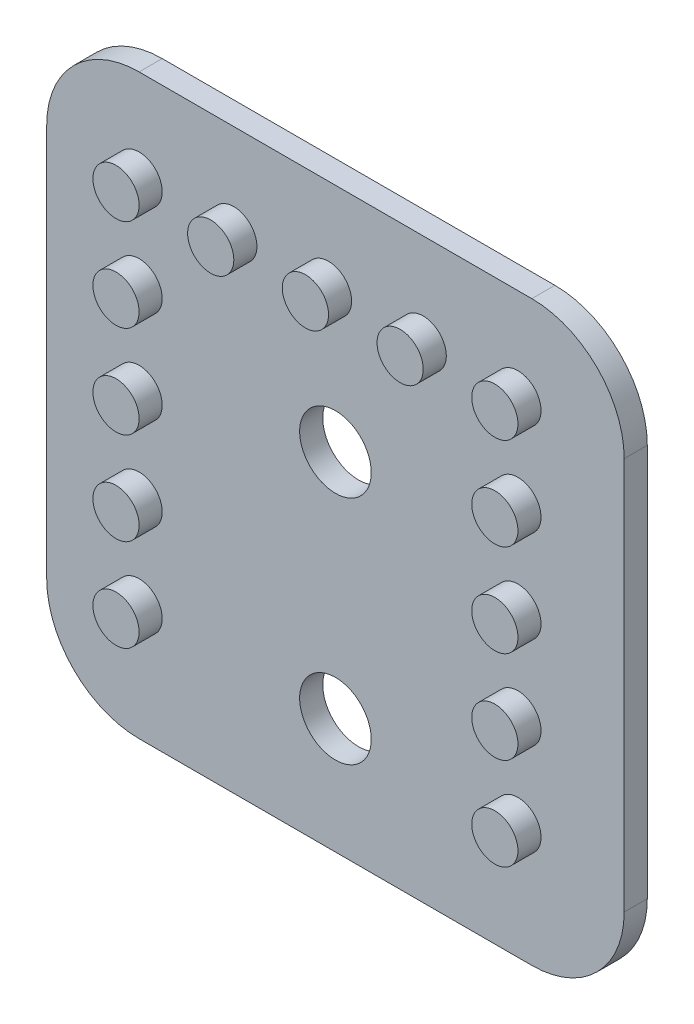
ISO-10303-21;
HEADER;
FILE_DESCRIPTION(('STEP AP214'),'2;1');
FILE_NAME('part.step','',(''),(''),'','','');
FILE_SCHEMA(('AUTOMOTIVE_DESIGN { 1 0 10303 214 1 1 1 1 }'));
ENDSEC;
DATA;
#1=APPLICATION_CONTEXT('core data for automotive mechanical design processes');
#2=APPLICATION_PROTOCOL_DEFINITION('international standard','automotive_design',2000,#1);
#3=PRODUCT_CONTEXT('',#1,'mechanical');
#4=PRODUCT('Part','Part','',(#3));
#5=PRODUCT_RELATED_PRODUCT_CATEGORY('part','',(#4));
#6=PRODUCT_DEFINITION_FORMATION('','',#4);
#7=PRODUCT_DEFINITION_CONTEXT('part definition',#1,'design');
#8=PRODUCT_DEFINITION('design','',#6,#7);
#9=PRODUCT_DEFINITION_SHAPE('','',#8);
#10=(LENGTH_UNIT() NAMED_UNIT(*) SI_UNIT(.MILLI.,.METRE.));
#11=(NAMED_UNIT(*) PLANE_ANGLE_UNIT() SI_UNIT($,.RADIAN.));
#12=(NAMED_UNIT(*) SI_UNIT($,.STERADIAN.) SOLID_ANGLE_UNIT());
#13=UNCERTAINTY_MEASURE_WITH_UNIT(LENGTH_MEASURE(1.E-05),#10,'distance_accuracy_value','');
#14=(GEOMETRIC_REPRESENTATION_CONTEXT(3) GLOBAL_UNCERTAINTY_ASSIGNED_CONTEXT((#13)) GLOBAL_UNIT_ASSIGNED_CONTEXT((#10,
#11,#12)) REPRESENTATION_CONTEXT('',''));
#15=CARTESIAN_POINT('',(0.,0.,0.));
#16=DIRECTION('',(0.,0.,1.));
#17=DIRECTION('',(1.,0.,0.));
#18=AXIS2_PLACEMENT_3D('',#15,#16,#17);
#19=CARTESIAN_POINT('',(0.,0.,1.));
#20=DIRECTION('',(0.,0.,1.));
#21=DIRECTION('',(1.,0.,0.));
#22=AXIS2_PLACEMENT_3D('',#19,#20,#21);
#23=PLANE('',#22);
#24=CARTESIAN_POINT('',(-23.5,13.,1.));
#25=DIRECTION('',(0.,0.,1.));
#26=DIRECTION('',(1.,0.,0.));
#27=AXIS2_PLACEMENT_3D('',#24,#25,#26);
#28=CIRCLE('',#27,1.55);
#29=CARTESIAN_POINT('',(-21.95,13.,1.));
#30=VERTEX_POINT('',#29);
#31=EDGE_CURVE('E257',#30,#30,#28,.T.);
#32=ORIENTED_EDGE('',*,*,#31,.F.);
#33=EDGE_LOOP('',(#32));
#34=FACE_BOUND('',#33,.T.);
#35=CARTESIAN_POINT('',(-23.5,23.,1.));
#36=DIRECTION('',(0.,0.,1.));
#37=DIRECTION('',(1.,0.,0.));
#38=AXIS2_PLACEMENT_3D('',#35,#36,#37);
#39=CIRCLE('',#38,1.55);
#40=CARTESIAN_POINT('',(-21.95,23.,1.));
#41=VERTEX_POINT('',#40);
#42=EDGE_CURVE('E251',#41,#41,#39,.T.);
#43=ORIENTED_EDGE('',*,*,#42,.F.);
#44=EDGE_LOOP('',(#43));
#45=FACE_BOUND('',#44,.T.);
#46=CARTESIAN_POINT('',(-31.9999999999998,13.,1.));
#47=DIRECTION('',(0.,0.,1.));
#48=DIRECTION('',(1.,0.,0.));
#49=AXIS2_PLACEMENT_3D('',#46,#47,#48);
#50=CIRCLE('',#49,0.999999999999998);
#51=CARTESIAN_POINT('',(-30.9999999999998,13.,1.));
#52=VERTEX_POINT('',#51);
#53=EDGE_CURVE('E237',#52,#52,#50,.T.);
#54=ORIENTED_EDGE('',*,*,#53,.F.);
#55=EDGE_LOOP('',(#54));
#56=FACE_BOUND('',#55,.T.);
#57=CARTESIAN_POINT('',(-31.9999999999999,17.,1.));
#58=DIRECTION('',(0.,0.,1.));
#59=DIRECTION('',(1.,0.,0.));
#60=AXIS2_PLACEMENT_3D('',#57,#58,#59);
#61=CIRCLE('',#60,0.999999999999998);
#62=CARTESIAN_POINT('',(-30.9999999999999,17.,1.));
#63=VERTEX_POINT('',#62);
#64=EDGE_CURVE('E225',#63,#63,#61,.T.);
#65=ORIENTED_EDGE('',*,*,#64,.F.);
#66=EDGE_LOOP('',(#65));
#67=FACE_BOUND('',#66,.T.);
#68=CARTESIAN_POINT('',(-31.9999999999999,21.,1.));
#69=DIRECTION('',(0.,0.,1.));
#70=DIRECTION('',(1.,0.,0.));
#71=AXIS2_PLACEMENT_3D('',#68,#69,#70);
#72=CIRCLE('',#71,0.999999999999998);
#73=CARTESIAN_POINT('',(-30.9999999999999,21.,1.));
#74=VERTEX_POINT('',#73);
#75=EDGE_CURVE('E213',#74,#74,#72,.T.);
#76=ORIENTED_EDGE('',*,*,#75,.F.);
#77=EDGE_LOOP('',(#76));
#78=FACE_BOUND('',#77,.T.);
#79=CARTESIAN_POINT('',(-32.,25.,1.));
#80=DIRECTION('',(0.,0.,1.));
#81=DIRECTION('',(1.,0.,0.));
#82=AXIS2_PLACEMENT_3D('',#79,#80,#81);
#83=CIRCLE('',#82,0.999999999999998);
#84=CARTESIAN_POINT('',(-31.,25.,1.));
#85=VERTEX_POINT('',#84);
#86=EDGE_CURVE('E201',#85,#85,#83,.T.);
#87=ORIENTED_EDGE('',*,*,#86,.F.);
#88=EDGE_LOOP('',(#87));
#89=FACE_BOUND('',#88,.T.);
#90=CARTESIAN_POINT('',(-19.7,29.,1.));
#91=DIRECTION('',(0.,0.,1.));
#92=DIRECTION('',(1.,0.,0.));
#93=AXIS2_PLACEMENT_3D('',#90,#91,#92);
#94=CIRCLE('',#93,0.999999999999998);
#95=CARTESIAN_POINT('',(-18.7,29.,1.));
#96=VERTEX_POINT('',#95);
#97=EDGE_CURVE('E189',#96,#96,#94,.T.);
#98=ORIENTED_EDGE('',*,*,#97,.F.);
#99=EDGE_LOOP('',(#98));
#100=FACE_BOUND('',#99,.T.);
#101=CARTESIAN_POINT('',(-27.9,29.,1.));
#102=DIRECTION('',(0.,0.,1.));
#103=DIRECTION('',(1.,0.,0.));
#104=AXIS2_PLACEMENT_3D('',#101,#102,#103);
#105=CIRCLE('',#104,0.999999999999998);
#106=CARTESIAN_POINT('',(-26.9,29.,1.));
#107=VERTEX_POINT('',#106);
#108=EDGE_CURVE('E177',#107,#107,#105,.T.);
#109=ORIENTED_EDGE('',*,*,#108,.F.);
#110=EDGE_LOOP('',(#109));
#111=FACE_BOUND('',#110,.T.);
#112=DIRECTION('',(0.,-1.,0.));
#113=VECTOR('',#112,1.);
#114=CARTESIAN_POINT('',(-36.,8.,1.));
#115=LINE('',#114,#113);
#116=CARTESIAN_POINT('',(-36.,29.,1.));
#117=VERTEX_POINT('',#116);
#118=CARTESIAN_POINT('',(-36.,12.,1.));
#119=VERTEX_POINT('',#118);
#120=EDGE_CURVE('E170',#117,#119,#115,.T.);
#121=ORIENTED_EDGE('',*,*,#120,.T.);
#122=CARTESIAN_POINT('',(-32.,12.,1.));
#123=DIRECTION('',(0.,0.,1.));
#124=DIRECTION('',(1.,0.,0.));
#125=AXIS2_PLACEMENT_3D('',#122,#123,#124);
#126=CIRCLE('',#125,4.);
#127=CARTESIAN_POINT('',(-32.,8.,1.));
#128=VERTEX_POINT('',#127);
#129=EDGE_CURVE('E147',#119,#128,#126,.T.);
#130=ORIENTED_EDGE('',*,*,#129,.T.);
#131=DIRECTION('',(1.,0.,0.));
#132=VECTOR('',#131,1.);
#133=CARTESIAN_POINT('',(-11.,8.00000000000001,1.));
#134=LINE('',#133,#132);
#135=CARTESIAN_POINT('',(-15.,8.00000000000001,1.));
#136=VERTEX_POINT('',#135);
#137=EDGE_CURVE('E119',#128,#136,#134,.T.);
#138=ORIENTED_EDGE('',*,*,#137,.T.);
#139=CARTESIAN_POINT('',(-15.,12.,1.));
#140=DIRECTION('',(0.,0.,1.));
#141=DIRECTION('',(1.,0.,0.));
#142=AXIS2_PLACEMENT_3D('',#139,#140,#141);
#143=CIRCLE('',#142,4.);
#144=CARTESIAN_POINT('',(-11.,12.,1.));
#145=VERTEX_POINT('',#144);
#146=EDGE_CURVE('E145',#136,#145,#143,.T.);
#147=ORIENTED_EDGE('',*,*,#146,.T.);
#148=DIRECTION('',(0.,1.,0.));
#149=VECTOR('',#148,1.);
#150=CARTESIAN_POINT('',(-11.,8.00000000000001,1.));
#151=LINE('',#150,#149);
#152=CARTESIAN_POINT('',(-11.,29.,1.));
#153=VERTEX_POINT('',#152);
#154=EDGE_CURVE('E125',#145,#153,#151,.T.);
#155=ORIENTED_EDGE('',*,*,#154,.T.);
#156=CARTESIAN_POINT('',(-15.,29.,1.));
#157=DIRECTION('',(0.,0.,1.));
#158=DIRECTION('',(1.,0.,0.));
#159=AXIS2_PLACEMENT_3D('',#156,#157,#158);
#160=CIRCLE('',#159,4.);
#161=CARTESIAN_POINT('',(-15.,33.,1.));
#162=VERTEX_POINT('',#161);
#163=EDGE_CURVE('E54',#153,#162,#160,.T.);
#164=ORIENTED_EDGE('',*,*,#163,.T.);
#165=DIRECTION('',(-1.,0.,0.));
#166=VECTOR('',#165,1.);
#167=CARTESIAN_POINT('',(-11.,33.,1.));
#168=LINE('',#167,#166);
#169=CARTESIAN_POINT('',(-32.,33.,1.));
#170=VERTEX_POINT('',#169);
#171=EDGE_CURVE('E128',#162,#170,#168,.T.);
#172=ORIENTED_EDGE('',*,*,#171,.T.);
#173=CARTESIAN_POINT('',(-32.,29.,1.));
#174=DIRECTION('',(0.,0.,1.));
#175=DIRECTION('',(1.,0.,0.));
#176=AXIS2_PLACEMENT_3D('',#173,#174,#175);
#177=CIRCLE('',#176,4.);
#178=EDGE_CURVE('E142',#170,#117,#177,.T.);
#179=ORIENTED_EDGE('',*,*,#178,.T.);
#180=EDGE_LOOP('',(#121,#130,#138,#147,#155,#164,#172,#179));
#181=FACE_BOUND('',#180,.T.);
#182=CARTESIAN_POINT('',(-32.,29.,1.));
#183=DIRECTION('',(0.,0.,1.));
#184=DIRECTION('',(1.,0.,0.));
#185=AXIS2_PLACEMENT_3D('',#182,#183,#184);
#186=CIRCLE('',#185,0.999999999999998);
#187=CARTESIAN_POINT('',(-31.,29.,1.));
#188=VERTEX_POINT('',#187);
#189=EDGE_CURVE('E166',#188,#188,#186,.T.);
#190=ORIENTED_EDGE('',*,*,#189,.F.);
#191=EDGE_LOOP('',(#190));
#192=FACE_BOUND('',#191,.T.);
#193=CARTESIAN_POINT('',(-23.8,29.,1.));
#194=DIRECTION('',(0.,0.,1.));
#195=DIRECTION('',(1.,0.,0.));
#196=AXIS2_PLACEMENT_3D('',#193,#194,#195);
#197=CIRCLE('',#196,0.999999999999998);
#198=CARTESIAN_POINT('',(-22.8,29.,1.));
#199=VERTEX_POINT('',#198);
#200=EDGE_CURVE('E183',#199,#199,#197,.T.);
#201=ORIENTED_EDGE('',*,*,#200,.F.);
#202=EDGE_LOOP('',(#201));
#203=FACE_BOUND('',#202,.T.);
#204=CARTESIAN_POINT('',(-15.6,29.,1.));
#205=DIRECTION('',(0.,0.,1.));
#206=DIRECTION('',(1.,0.,0.));
#207=AXIS2_PLACEMENT_3D('',#204,#205,#206);
#208=CIRCLE('',#207,0.999999999999998);
#209=CARTESIAN_POINT('',(-14.6,29.,1.));
#210=VERTEX_POINT('',#209);
#211=EDGE_CURVE('E195',#210,#210,#208,.T.);
#212=ORIENTED_EDGE('',*,*,#211,.F.);
#213=EDGE_LOOP('',(#212));
#214=FACE_BOUND('',#213,.T.);
#215=CARTESIAN_POINT('',(-15.6,25.,1.));
#216=DIRECTION('',(0.,0.,1.));
#217=DIRECTION('',(1.,0.,0.));
#218=AXIS2_PLACEMENT_3D('',#215,#216,#217);
#219=CIRCLE('',#218,0.999999999999998);
#220=CARTESIAN_POINT('',(-14.6,25.,1.));
#221=VERTEX_POINT('',#220);
#222=EDGE_CURVE('E207',#221,#221,#219,.T.);
#223=ORIENTED_EDGE('',*,*,#222,.F.);
#224=EDGE_LOOP('',(#223));
#225=FACE_BOUND('',#224,.T.);
#226=CARTESIAN_POINT('',(-15.5999999999999,21.,1.));
#227=DIRECTION('',(0.,0.,1.));
#228=DIRECTION('',(1.,0.,0.));
#229=AXIS2_PLACEMENT_3D('',#226,#227,#228);
#230=CIRCLE('',#229,0.999999999999998);
#231=CARTESIAN_POINT('',(-14.5999999999999,21.,1.));
#232=VERTEX_POINT('',#231);
#233=EDGE_CURVE('E219',#232,#232,#230,.T.);
#234=ORIENTED_EDGE('',*,*,#233,.F.);
#235=EDGE_LOOP('',(#234));
#236=FACE_BOUND('',#235,.T.);
#237=CARTESIAN_POINT('',(-15.5999999999999,17.,1.));
#238=DIRECTION('',(0.,0.,1.));
#239=DIRECTION('',(1.,0.,0.));
#240=AXIS2_PLACEMENT_3D('',#237,#238,#239);
#241=CIRCLE('',#240,0.999999999999998);
#242=CARTESIAN_POINT('',(-14.5999999999999,17.,1.));
#243=VERTEX_POINT('',#242);
#244=EDGE_CURVE('E231',#243,#243,#241,.T.);
#245=ORIENTED_EDGE('',*,*,#244,.F.);
#246=EDGE_LOOP('',(#245));
#247=FACE_BOUND('',#246,.T.);
#248=CARTESIAN_POINT('',(-15.5999999999998,13.,1.));
#249=DIRECTION('',(0.,0.,1.));
#250=DIRECTION('',(1.,0.,0.));
#251=AXIS2_PLACEMENT_3D('',#248,#249,#250);
#252=CIRCLE('',#251,0.999999999999998);
#253=CARTESIAN_POINT('',(-14.5999999999998,13.,1.));
#254=VERTEX_POINT('',#253);
#255=EDGE_CURVE('E243',#254,#254,#252,.T.);
#256=ORIENTED_EDGE('',*,*,#255,.F.);
#257=EDGE_LOOP('',(#256));
#258=FACE_BOUND('',#257,.T.);
#259=ADVANCED_FACE('F33',(#34,#45,#56,#67,#78,#89,#100,#111,#181,#192,#203,#214,#225,#236,#247,
#258),#23,.T.);
#260=CARTESIAN_POINT('',(-11.,8.00000000000001,1.));
#261=DIRECTION('',(-1.,0.,0.));
#262=DIRECTION('',(0.,0.,1.));
#263=AXIS2_PLACEMENT_3D('',#260,#261,#262);
#264=PLANE('',#263);
#265=ORIENTED_EDGE('',*,*,#154,.F.);
#266=DIRECTION('',(0.,0.,-1.));
#267=VECTOR('',#266,1.);
#268=CARTESIAN_POINT('',(-11.,12.,1.));
#269=LINE('',#268,#267);
#270=CARTESIAN_POINT('',(-11.,12.,0.));
#271=VERTEX_POINT('',#270);
#272=EDGE_CURVE('E151',#145,#271,#269,.T.);
#273=ORIENTED_EDGE('',*,*,#272,.T.);
#274=DIRECTION('',(0.,1.,0.));
#275=VECTOR('',#274,1.);
#276=CARTESIAN_POINT('',(-11.,8.00000000000001,0.));
#277=LINE('',#276,#275);
#278=CARTESIAN_POINT('',(-11.,29.,0.));
#279=VERTEX_POINT('',#278);
#280=EDGE_CURVE('E158',#271,#279,#277,.T.);
#281=ORIENTED_EDGE('',*,*,#280,.T.);
#282=DIRECTION('',(0.,0.,-1.));
#283=VECTOR('',#282,1.);
#284=CARTESIAN_POINT('',(-11.,29.,1.));
#285=LINE('',#284,#283);
#286=EDGE_CURVE('E149',#279,#153,#285,.F.);
#287=ORIENTED_EDGE('',*,*,#286,.T.);
#288=EDGE_LOOP('',(#265,#273,#281,#287));
#289=FACE_BOUND('',#288,.T.);
#290=ADVANCED_FACE('F157',(#289),#264,.F.);
#291=CARTESIAN_POINT('',(-11.,33.,1.));
#292=DIRECTION('',(0.,-1.,0.));
#293=DIRECTION('',(0.,0.,-1.));
#294=AXIS2_PLACEMENT_3D('',#291,#292,#293);
#295=PLANE('',#294);
#296=ORIENTED_EDGE('',*,*,#171,.F.);
#297=DIRECTION('',(0.,0.,-1.));
#298=VECTOR('',#297,1.);
#299=CARTESIAN_POINT('',(-15.,33.,1.));
#300=LINE('',#299,#298);
#301=CARTESIAN_POINT('',(-15.,33.,0.));
#302=VERTEX_POINT('',#301);
#303=EDGE_CURVE('E11',#162,#302,#300,.T.);
#304=ORIENTED_EDGE('',*,*,#303,.T.);
#305=DIRECTION('',(-1.,0.,0.));
#306=VECTOR('',#305,1.);
#307=CARTESIAN_POINT('',(-11.,33.,0.));
#308=LINE('',#307,#306);
#309=CARTESIAN_POINT('',(-32.,33.,0.));
#310=VERTEX_POINT('',#309);
#311=EDGE_CURVE('E130',#302,#310,#308,.T.);
#312=ORIENTED_EDGE('',*,*,#311,.T.);
#313=DIRECTION('',(0.,0.,-1.));
#314=VECTOR('',#313,1.);
#315=CARTESIAN_POINT('',(-32.,33.,1.));
#316=LINE('',#315,#314);
#317=EDGE_CURVE('E41',#310,#170,#316,.F.);
#318=ORIENTED_EDGE('',*,*,#317,.T.);
#319=EDGE_LOOP('',(#296,#304,#312,#318));
#320=FACE_BOUND('',#319,.T.);
#321=ADVANCED_FACE('F413',(#320),#295,.F.);
#322=CARTESIAN_POINT('',(-36.,8.,1.));
#323=DIRECTION('',(1.,0.,0.));
#324=DIRECTION('',(0.,0.,-1.));
#325=AXIS2_PLACEMENT_3D('',#322,#323,#324);
#326=PLANE('',#325);
#327=DIRECTION('',(0.,-1.,0.));
#328=VECTOR('',#327,1.);
#329=CARTESIAN_POINT('',(-36.,8.,0.));
#330=LINE('',#329,#328);
#331=CARTESIAN_POINT('',(-36.,29.,0.));
#332=VERTEX_POINT('',#331);
#333=CARTESIAN_POINT('',(-36.,12.,0.));
#334=VERTEX_POINT('',#333);
#335=EDGE_CURVE('E126',#332,#334,#330,.T.);
#336=ORIENTED_EDGE('',*,*,#335,.T.);
#337=DIRECTION('',(0.,0.,-1.));
#338=VECTOR('',#337,1.);
#339=CARTESIAN_POINT('',(-36.,12.,1.));
#340=LINE('',#339,#338);
#341=EDGE_CURVE('E104',#334,#119,#340,.F.);
#342=ORIENTED_EDGE('',*,*,#341,.T.);
#343=ORIENTED_EDGE('',*,*,#120,.F.);
#344=DIRECTION('',(0.,0.,-1.));
#345=VECTOR('',#344,1.);
#346=CARTESIAN_POINT('',(-36.,29.,1.));
#347=LINE('',#346,#345);
#348=EDGE_CURVE('E109',#117,#332,#347,.T.);
#349=ORIENTED_EDGE('',*,*,#348,.T.);
#350=EDGE_LOOP('',(#336,#342,#343,#349));
#351=FACE_BOUND('',#350,.T.);
#352=ADVANCED_FACE('F410',(#351),#326,.F.);
#353=CARTESIAN_POINT('',(-11.,8.00000000000001,1.));
#354=DIRECTION('',(0.,1.,0.));
#355=DIRECTION('',(-1.,0.,0.));
#356=AXIS2_PLACEMENT_3D('',#353,#354,#355);
#357=PLANE('',#356);
#358=ORIENTED_EDGE('',*,*,#137,.F.);
#359=DIRECTION('',(0.,0.,-1.));
#360=VECTOR('',#359,1.);
#361=CARTESIAN_POINT('',(-32.,8.,1.));
#362=LINE('',#361,#360);
#363=CARTESIAN_POINT('',(-32.,8.,0.));
#364=VERTEX_POINT('',#363);
#365=EDGE_CURVE('E103',#128,#364,#362,.T.);
#366=ORIENTED_EDGE('',*,*,#365,.T.);
#367=DIRECTION('',(1.,0.,0.));
#368=VECTOR('',#367,1.);
#369=CARTESIAN_POINT('',(-11.,8.00000000000001,0.));
#370=LINE('',#369,#368);
#371=CARTESIAN_POINT('',(-15.,8.00000000000001,0.));
#372=VERTEX_POINT('',#371);
#373=EDGE_CURVE('E116',#364,#372,#370,.T.);
#374=ORIENTED_EDGE('',*,*,#373,.T.);
#375=DIRECTION('',(0.,0.,-1.));
#376=VECTOR('',#375,1.);
#377=CARTESIAN_POINT('',(-15.,8.00000000000001,1.));
#378=LINE('',#377,#376);
#379=EDGE_CURVE('E121',#372,#136,#378,.F.);
#380=ORIENTED_EDGE('',*,*,#379,.T.);
#381=EDGE_LOOP('',(#358,#366,#374,#380));
#382=FACE_BOUND('',#381,.T.);
#383=ADVANCED_FACE('F115',(#382),#357,.F.);
#384=CARTESIAN_POINT('',(0.,0.,0.));
#385=DIRECTION('',(0.,0.,1.));
#386=DIRECTION('',(1.,0.,0.));
#387=AXIS2_PLACEMENT_3D('',#384,#385,#386);
#388=PLANE('',#387);
#389=CARTESIAN_POINT('',(-23.5,13.,0.));
#390=DIRECTION('',(0.,0.,1.));
#391=DIRECTION('',(1.,0.,0.));
#392=AXIS2_PLACEMENT_3D('',#389,#390,#391);
#393=CIRCLE('',#392,1.55);
#394=CARTESIAN_POINT('',(-21.95,13.,0.));
#395=VERTEX_POINT('',#394);
#396=EDGE_CURVE('E254',#395,#395,#393,.F.);
#397=ORIENTED_EDGE('',*,*,#396,.F.);
#398=EDGE_LOOP('',(#397));
#399=FACE_BOUND('',#398,.T.);
#400=CARTESIAN_POINT('',(-23.5,23.,0.));
#401=DIRECTION('',(0.,0.,1.));
#402=DIRECTION('',(1.,0.,0.));
#403=AXIS2_PLACEMENT_3D('',#400,#401,#402);
#404=CIRCLE('',#403,1.55);
#405=CARTESIAN_POINT('',(-21.95,23.,0.));
#406=VERTEX_POINT('',#405);
#407=EDGE_CURVE('E246',#406,#406,#404,.F.);
#408=ORIENTED_EDGE('',*,*,#407,.F.);
#409=EDGE_LOOP('',(#408));
#410=FACE_BOUND('',#409,.T.);
#411=ORIENTED_EDGE('',*,*,#373,.F.);
#412=CARTESIAN_POINT('',(-32.,12.,0.));
#413=DIRECTION('',(0.,0.,1.));
#414=DIRECTION('',(1.,0.,0.));
#415=AXIS2_PLACEMENT_3D('',#412,#413,#414);
#416=CIRCLE('',#415,4.);
#417=EDGE_CURVE('E99',#364,#334,#416,.F.);
#418=ORIENTED_EDGE('',*,*,#417,.T.);
#419=ORIENTED_EDGE('',*,*,#335,.F.);
#420=CARTESIAN_POINT('',(-32.,29.,0.));
#421=DIRECTION('',(0.,0.,1.));
#422=DIRECTION('',(1.,0.,0.));
#423=AXIS2_PLACEMENT_3D('',#420,#421,#422);
#424=CIRCLE('',#423,4.);
#425=EDGE_CURVE('E120',#332,#310,#424,.F.);
#426=ORIENTED_EDGE('',*,*,#425,.T.);
#427=ORIENTED_EDGE('',*,*,#311,.F.);
#428=CARTESIAN_POINT('',(-15.,29.,0.));
#429=DIRECTION('',(0.,0.,1.));
#430=DIRECTION('',(1.,0.,0.));
#431=AXIS2_PLACEMENT_3D('',#428,#429,#430);
#432=CIRCLE('',#431,4.);
#433=EDGE_CURVE('E136',#302,#279,#432,.F.);
#434=ORIENTED_EDGE('',*,*,#433,.T.);
#435=ORIENTED_EDGE('',*,*,#280,.F.);
#436=CARTESIAN_POINT('',(-15.,12.,0.));
#437=DIRECTION('',(0.,0.,1.));
#438=DIRECTION('',(1.,0.,0.));
#439=AXIS2_PLACEMENT_3D('',#436,#437,#438);
#440=CIRCLE('',#439,4.);
#441=EDGE_CURVE('E110',#271,#372,#440,.F.);
#442=ORIENTED_EDGE('',*,*,#441,.T.);
#443=EDGE_LOOP('',(#411,#418,#419,#426,#427,#434,#435,#442));
#444=FACE_BOUND('',#443,.T.);
#445=ADVANCED_FACE('F123',(#399,#410,#444),#388,.F.);
#446=CARTESIAN_POINT('',(-32.,29.,2.));
#447=DIRECTION('',(0.,0.,-1.));
#448=DIRECTION('',(-1.,0.,0.));
#449=AXIS2_PLACEMENT_3D('',#446,#447,#448);
#450=CYLINDRICAL_SURFACE('',#449,0.999999999999998);
#451=CARTESIAN_POINT('',(-32.,29.,2.));
#452=DIRECTION('',(0.,0.,1.));
#453=DIRECTION('',(1.,0.,0.));
#454=AXIS2_PLACEMENT_3D('',#451,#452,#453);
#455=CIRCLE('',#454,0.999999999999998);
#456=CARTESIAN_POINT('',(-31.,29.,2.));
#457=VERTEX_POINT('',#456);
#458=EDGE_CURVE('E163',#457,#457,#455,.T.);
#459=ORIENTED_EDGE('',*,*,#458,.F.);
#460=EDGE_LOOP('',(#459));
#461=FACE_BOUND('',#460,.T.);
#462=ORIENTED_EDGE('',*,*,#189,.T.);
#463=EDGE_LOOP('',(#462));
#464=FACE_BOUND('',#463,.T.);
#465=ADVANCED_FACE('F400',(#461,#464),#450,.T.);
#466=CARTESIAN_POINT('',(-32.,29.,2.));
#467=DIRECTION('',(0.,0.,1.));
#468=DIRECTION('',(1.,0.,0.));
#469=AXIS2_PLACEMENT_3D('',#466,#467,#468);
#470=PLANE('',#469);
#471=ORIENTED_EDGE('',*,*,#458,.T.);
#472=EDGE_LOOP('',(#471));
#473=FACE_BOUND('',#472,.T.);
#474=ADVANCED_FACE('F396',(#473),#470,.T.);
#475=CARTESIAN_POINT('',(-27.9,29.,2.));
#476=DIRECTION('',(0.,0.,-1.));
#477=DIRECTION('',(-1.,0.,0.));
#478=AXIS2_PLACEMENT_3D('',#475,#476,#477);
#479=CYLINDRICAL_SURFACE('',#478,0.999999999999998);
#480=CARTESIAN_POINT('',(-27.9,29.,2.));
#481=DIRECTION('',(0.,0.,1.));
#482=DIRECTION('',(1.,0.,0.));
#483=AXIS2_PLACEMENT_3D('',#480,#481,#482);
#484=CIRCLE('',#483,0.999999999999998);
#485=CARTESIAN_POINT('',(-26.9,29.,2.));
#486=VERTEX_POINT('',#485);
#487=EDGE_CURVE('E175',#486,#486,#484,.T.);
#488=ORIENTED_EDGE('',*,*,#487,.F.);
#489=EDGE_LOOP('',(#488));
#490=FACE_BOUND('',#489,.T.);
#491=ORIENTED_EDGE('',*,*,#108,.T.);
#492=EDGE_LOOP('',(#491));
#493=FACE_BOUND('',#492,.T.);
#494=ADVANCED_FACE('F392',(#490,#493),#479,.T.);
#495=CARTESIAN_POINT('',(-27.9,29.,2.));
#496=DIRECTION('',(0.,0.,1.));
#497=DIRECTION('',(1.,0.,0.));
#498=AXIS2_PLACEMENT_3D('',#495,#496,#497);
#499=PLANE('',#498);
#500=ORIENTED_EDGE('',*,*,#487,.T.);
#501=EDGE_LOOP('',(#500));
#502=FACE_BOUND('',#501,.T.);
#503=ADVANCED_FACE('F388',(#502),#499,.T.);
#504=CARTESIAN_POINT('',(-23.8,29.,2.));
#505=DIRECTION('',(0.,0.,-1.));
#506=DIRECTION('',(-1.,0.,0.));
#507=AXIS2_PLACEMENT_3D('',#504,#505,#506);
#508=CYLINDRICAL_SURFACE('',#507,0.999999999999998);
#509=CARTESIAN_POINT('',(-23.8,29.,2.));
#510=DIRECTION('',(0.,0.,1.));
#511=DIRECTION('',(1.,0.,0.));
#512=AXIS2_PLACEMENT_3D('',#509,#510,#511);
#513=CIRCLE('',#512,0.999999999999998);
#514=CARTESIAN_POINT('',(-22.8,29.,2.));
#515=VERTEX_POINT('',#514);
#516=EDGE_CURVE('E180',#515,#515,#513,.T.);
#517=ORIENTED_EDGE('',*,*,#516,.F.);
#518=EDGE_LOOP('',(#517));
#519=FACE_BOUND('',#518,.T.);
#520=ORIENTED_EDGE('',*,*,#200,.T.);
#521=EDGE_LOOP('',(#520));
#522=FACE_BOUND('',#521,.T.);
#523=ADVANCED_FACE('F384',(#519,#522),#508,.T.);
#524=CARTESIAN_POINT('',(-23.8,29.,2.));
#525=DIRECTION('',(0.,0.,1.));
#526=DIRECTION('',(1.,0.,0.));
#527=AXIS2_PLACEMENT_3D('',#524,#525,#526);
#528=PLANE('',#527);
#529=ORIENTED_EDGE('',*,*,#516,.T.);
#530=EDGE_LOOP('',(#529));
#531=FACE_BOUND('',#530,.T.);
#532=ADVANCED_FACE('F380',(#531),#528,.T.);
#533=CARTESIAN_POINT('',(-19.7,29.,2.));
#534=DIRECTION('',(0.,0.,-1.));
#535=DIRECTION('',(-1.,0.,0.));
#536=AXIS2_PLACEMENT_3D('',#533,#534,#535);
#537=CYLINDRICAL_SURFACE('',#536,0.999999999999998);
#538=CARTESIAN_POINT('',(-19.7,29.,2.));
#539=DIRECTION('',(0.,0.,1.));
#540=DIRECTION('',(1.,0.,0.));
#541=AXIS2_PLACEMENT_3D('',#538,#539,#540);
#542=CIRCLE('',#541,0.999999999999998);
#543=CARTESIAN_POINT('',(-18.7,29.,2.));
#544=VERTEX_POINT('',#543);
#545=EDGE_CURVE('E186',#544,#544,#542,.T.);
#546=ORIENTED_EDGE('',*,*,#545,.F.);
#547=EDGE_LOOP('',(#546));
#548=FACE_BOUND('',#547,.T.);
#549=ORIENTED_EDGE('',*,*,#97,.T.);
#550=EDGE_LOOP('',(#549));
#551=FACE_BOUND('',#550,.T.);
#552=ADVANCED_FACE('F376',(#548,#551),#537,.T.);
#553=CARTESIAN_POINT('',(-19.7,29.,2.));
#554=DIRECTION('',(0.,0.,1.));
#555=DIRECTION('',(1.,0.,0.));
#556=AXIS2_PLACEMENT_3D('',#553,#554,#555);
#557=PLANE('',#556);
#558=ORIENTED_EDGE('',*,*,#545,.T.);
#559=EDGE_LOOP('',(#558));
#560=FACE_BOUND('',#559,.T.);
#561=ADVANCED_FACE('F372',(#560),#557,.T.);
#562=CARTESIAN_POINT('',(-15.6,29.,2.));
#563=DIRECTION('',(0.,0.,-1.));
#564=DIRECTION('',(-1.,0.,0.));
#565=AXIS2_PLACEMENT_3D('',#562,#563,#564);
#566=CYLINDRICAL_SURFACE('',#565,0.999999999999998);
#567=CARTESIAN_POINT('',(-15.6,29.,2.));
#568=DIRECTION('',(0.,0.,1.));
#569=DIRECTION('',(1.,0.,0.));
#570=AXIS2_PLACEMENT_3D('',#567,#568,#569);
#571=CIRCLE('',#570,0.999999999999998);
#572=CARTESIAN_POINT('',(-14.6,29.,2.));
#573=VERTEX_POINT('',#572);
#574=EDGE_CURVE('E192',#573,#573,#571,.T.);
#575=ORIENTED_EDGE('',*,*,#574,.F.);
#576=EDGE_LOOP('',(#575));
#577=FACE_BOUND('',#576,.T.);
#578=ORIENTED_EDGE('',*,*,#211,.T.);
#579=EDGE_LOOP('',(#578));
#580=FACE_BOUND('',#579,.T.);
#581=ADVANCED_FACE('F368',(#577,#580),#566,.T.);
#582=CARTESIAN_POINT('',(-15.6,29.,2.));
#583=DIRECTION('',(0.,0.,1.));
#584=DIRECTION('',(1.,0.,0.));
#585=AXIS2_PLACEMENT_3D('',#582,#583,#584);
#586=PLANE('',#585);
#587=ORIENTED_EDGE('',*,*,#574,.T.);
#588=EDGE_LOOP('',(#587));
#589=FACE_BOUND('',#588,.T.);
#590=ADVANCED_FACE('F364',(#589),#586,.T.);
#591=CARTESIAN_POINT('',(-32.,25.,2.));
#592=DIRECTION('',(0.,0.,-1.));
#593=DIRECTION('',(-1.,0.,0.));
#594=AXIS2_PLACEMENT_3D('',#591,#592,#593);
#595=CYLINDRICAL_SURFACE('',#594,0.999999999999998);
#596=CARTESIAN_POINT('',(-32.,25.,2.));
#597=DIRECTION('',(0.,0.,1.));
#598=DIRECTION('',(1.,0.,0.));
#599=AXIS2_PLACEMENT_3D('',#596,#597,#598);
#600=CIRCLE('',#599,0.999999999999998);
#601=CARTESIAN_POINT('',(-31.,25.,2.));
#602=VERTEX_POINT('',#601);
#603=EDGE_CURVE('E198',#602,#602,#600,.T.);
#604=ORIENTED_EDGE('',*,*,#603,.F.);
#605=EDGE_LOOP('',(#604));
#606=FACE_BOUND('',#605,.T.);
#607=ORIENTED_EDGE('',*,*,#86,.T.);
#608=EDGE_LOOP('',(#607));
#609=FACE_BOUND('',#608,.T.);
#610=ADVANCED_FACE('F360',(#606,#609),#595,.T.);
#611=CARTESIAN_POINT('',(-32.,25.,2.));
#612=DIRECTION('',(0.,0.,1.));
#613=DIRECTION('',(1.,0.,0.));
#614=AXIS2_PLACEMENT_3D('',#611,#612,#613);
#615=PLANE('',#614);
#616=ORIENTED_EDGE('',*,*,#603,.T.);
#617=EDGE_LOOP('',(#616));
#618=FACE_BOUND('',#617,.T.);
#619=ADVANCED_FACE('F356',(#618),#615,.T.);
#620=CARTESIAN_POINT('',(-15.6,25.,2.));
#621=DIRECTION('',(0.,0.,-1.));
#622=DIRECTION('',(-1.,0.,0.));
#623=AXIS2_PLACEMENT_3D('',#620,#621,#622);
#624=CYLINDRICAL_SURFACE('',#623,0.999999999999998);
#625=CARTESIAN_POINT('',(-15.6,25.,2.));
#626=DIRECTION('',(0.,0.,1.));
#627=DIRECTION('',(1.,0.,0.));
#628=AXIS2_PLACEMENT_3D('',#625,#626,#627);
#629=CIRCLE('',#628,0.999999999999998);
#630=CARTESIAN_POINT('',(-14.6,25.,2.));
#631=VERTEX_POINT('',#630);
#632=EDGE_CURVE('E204',#631,#631,#629,.T.);
#633=ORIENTED_EDGE('',*,*,#632,.F.);
#634=EDGE_LOOP('',(#633));
#635=FACE_BOUND('',#634,.T.);
#636=ORIENTED_EDGE('',*,*,#222,.T.);
#637=EDGE_LOOP('',(#636));
#638=FACE_BOUND('',#637,.T.);
#639=ADVANCED_FACE('F352',(#635,#638),#624,.T.);
#640=CARTESIAN_POINT('',(-15.6,25.,2.));
#641=DIRECTION('',(0.,0.,1.));
#642=DIRECTION('',(1.,0.,0.));
#643=AXIS2_PLACEMENT_3D('',#640,#641,#642);
#644=PLANE('',#643);
#645=ORIENTED_EDGE('',*,*,#632,.T.);
#646=EDGE_LOOP('',(#645));
#647=FACE_BOUND('',#646,.T.);
#648=ADVANCED_FACE('F348',(#647),#644,.T.);
#649=CARTESIAN_POINT('',(-31.9999999999999,21.,2.));
#650=DIRECTION('',(0.,0.,-1.));
#651=DIRECTION('',(-1.,0.,0.));
#652=AXIS2_PLACEMENT_3D('',#649,#650,#651);
#653=CYLINDRICAL_SURFACE('',#652,0.999999999999998);
#654=CARTESIAN_POINT('',(-31.9999999999999,21.,2.));
#655=DIRECTION('',(0.,0.,1.));
#656=DIRECTION('',(1.,0.,0.));
#657=AXIS2_PLACEMENT_3D('',#654,#655,#656);
#658=CIRCLE('',#657,0.999999999999998);
#659=CARTESIAN_POINT('',(-30.9999999999999,21.,2.));
#660=VERTEX_POINT('',#659);
#661=EDGE_CURVE('E210',#660,#660,#658,.T.);
#662=ORIENTED_EDGE('',*,*,#661,.F.);
#663=EDGE_LOOP('',(#662));
#664=FACE_BOUND('',#663,.T.);
#665=ORIENTED_EDGE('',*,*,#75,.T.);
#666=EDGE_LOOP('',(#665));
#667=FACE_BOUND('',#666,.T.);
#668=ADVANCED_FACE('F344',(#664,#667),#653,.T.);
#669=CARTESIAN_POINT('',(-31.9999999999999,21.,2.));
#670=DIRECTION('',(0.,0.,1.));
#671=DIRECTION('',(1.,0.,0.));
#672=AXIS2_PLACEMENT_3D('',#669,#670,#671);
#673=PLANE('',#672);
#674=ORIENTED_EDGE('',*,*,#661,.T.);
#675=EDGE_LOOP('',(#674));
#676=FACE_BOUND('',#675,.T.);
#677=ADVANCED_FACE('F340',(#676),#673,.T.);
#678=CARTESIAN_POINT('',(-15.5999999999999,21.,2.));
#679=DIRECTION('',(0.,0.,-1.));
#680=DIRECTION('',(-1.,0.,0.));
#681=AXIS2_PLACEMENT_3D('',#678,#679,#680);
#682=CYLINDRICAL_SURFACE('',#681,0.999999999999998);
#683=CARTESIAN_POINT('',(-15.5999999999999,21.,2.));
#684=DIRECTION('',(0.,0.,1.));
#685=DIRECTION('',(1.,0.,0.));
#686=AXIS2_PLACEMENT_3D('',#683,#684,#685);
#687=CIRCLE('',#686,0.999999999999998);
#688=CARTESIAN_POINT('',(-14.5999999999999,21.,2.));
#689=VERTEX_POINT('',#688);
#690=EDGE_CURVE('E216',#689,#689,#687,.T.);
#691=ORIENTED_EDGE('',*,*,#690,.F.);
#692=EDGE_LOOP('',(#691));
#693=FACE_BOUND('',#692,.T.);
#694=ORIENTED_EDGE('',*,*,#233,.T.);
#695=EDGE_LOOP('',(#694));
#696=FACE_BOUND('',#695,.T.);
#697=ADVANCED_FACE('F336',(#693,#696),#682,.T.);
#698=CARTESIAN_POINT('',(-15.5999999999999,21.,2.));
#699=DIRECTION('',(0.,0.,1.));
#700=DIRECTION('',(1.,0.,0.));
#701=AXIS2_PLACEMENT_3D('',#698,#699,#700);
#702=PLANE('',#701);
#703=ORIENTED_EDGE('',*,*,#690,.T.);
#704=EDGE_LOOP('',(#703));
#705=FACE_BOUND('',#704,.T.);
#706=ADVANCED_FACE('F332',(#705),#702,.T.);
#707=CARTESIAN_POINT('',(-31.9999999999999,17.,2.));
#708=DIRECTION('',(0.,0.,-1.));
#709=DIRECTION('',(-1.,0.,0.));
#710=AXIS2_PLACEMENT_3D('',#707,#708,#709);
#711=CYLINDRICAL_SURFACE('',#710,0.999999999999998);
#712=CARTESIAN_POINT('',(-31.9999999999999,17.,2.));
#713=DIRECTION('',(0.,0.,1.));
#714=DIRECTION('',(1.,0.,0.));
#715=AXIS2_PLACEMENT_3D('',#712,#713,#714);
#716=CIRCLE('',#715,0.999999999999998);
#717=CARTESIAN_POINT('',(-30.9999999999999,17.,2.));
#718=VERTEX_POINT('',#717);
#719=EDGE_CURVE('E222',#718,#718,#716,.T.);
#720=ORIENTED_EDGE('',*,*,#719,.F.);
#721=EDGE_LOOP('',(#720));
#722=FACE_BOUND('',#721,.T.);
#723=ORIENTED_EDGE('',*,*,#64,.T.);
#724=EDGE_LOOP('',(#723));
#725=FACE_BOUND('',#724,.T.);
#726=ADVANCED_FACE('F328',(#722,#725),#711,.T.);
#727=CARTESIAN_POINT('',(-31.9999999999999,17.,2.));
#728=DIRECTION('',(0.,0.,1.));
#729=DIRECTION('',(1.,0.,0.));
#730=AXIS2_PLACEMENT_3D('',#727,#728,#729);
#731=PLANE('',#730);
#732=ORIENTED_EDGE('',*,*,#719,.T.);
#733=EDGE_LOOP('',(#732));
#734=FACE_BOUND('',#733,.T.);
#735=ADVANCED_FACE('F324',(#734),#731,.T.);
#736=CARTESIAN_POINT('',(-15.5999999999999,17.,2.));
#737=DIRECTION('',(0.,0.,-1.));
#738=DIRECTION('',(-1.,0.,0.));
#739=AXIS2_PLACEMENT_3D('',#736,#737,#738);
#740=CYLINDRICAL_SURFACE('',#739,0.999999999999998);
#741=CARTESIAN_POINT('',(-15.5999999999999,17.,2.));
#742=DIRECTION('',(0.,0.,1.));
#743=DIRECTION('',(1.,0.,0.));
#744=AXIS2_PLACEMENT_3D('',#741,#742,#743);
#745=CIRCLE('',#744,0.999999999999998);
#746=CARTESIAN_POINT('',(-14.5999999999999,17.,2.));
#747=VERTEX_POINT('',#746);
#748=EDGE_CURVE('E228',#747,#747,#745,.T.);
#749=ORIENTED_EDGE('',*,*,#748,.F.);
#750=EDGE_LOOP('',(#749));
#751=FACE_BOUND('',#750,.T.);
#752=ORIENTED_EDGE('',*,*,#244,.T.);
#753=EDGE_LOOP('',(#752));
#754=FACE_BOUND('',#753,.T.);
#755=ADVANCED_FACE('F320',(#751,#754),#740,.T.);
#756=CARTESIAN_POINT('',(-15.5999999999999,17.,2.));
#757=DIRECTION('',(0.,0.,1.));
#758=DIRECTION('',(1.,0.,0.));
#759=AXIS2_PLACEMENT_3D('',#756,#757,#758);
#760=PLANE('',#759);
#761=ORIENTED_EDGE('',*,*,#748,.T.);
#762=EDGE_LOOP('',(#761));
#763=FACE_BOUND('',#762,.T.);
#764=ADVANCED_FACE('F316',(#763),#760,.T.);
#765=CARTESIAN_POINT('',(-31.9999999999998,13.,2.));
#766=DIRECTION('',(0.,0.,-1.));
#767=DIRECTION('',(-1.,0.,0.));
#768=AXIS2_PLACEMENT_3D('',#765,#766,#767);
#769=CYLINDRICAL_SURFACE('',#768,0.999999999999998);
#770=CARTESIAN_POINT('',(-31.9999999999998,13.,2.));
#771=DIRECTION('',(0.,0.,1.));
#772=DIRECTION('',(1.,0.,0.));
#773=AXIS2_PLACEMENT_3D('',#770,#771,#772);
#774=CIRCLE('',#773,0.999999999999998);
#775=CARTESIAN_POINT('',(-30.9999999999998,13.,2.));
#776=VERTEX_POINT('',#775);
#777=EDGE_CURVE('E234',#776,#776,#774,.T.);
#778=ORIENTED_EDGE('',*,*,#777,.F.);
#779=EDGE_LOOP('',(#778));
#780=FACE_BOUND('',#779,.T.);
#781=ORIENTED_EDGE('',*,*,#53,.T.);
#782=EDGE_LOOP('',(#781));
#783=FACE_BOUND('',#782,.T.);
#784=ADVANCED_FACE('F308',(#780,#783),#769,.T.);
#785=CARTESIAN_POINT('',(-31.9999999999998,13.,2.));
#786=DIRECTION('',(0.,0.,1.));
#787=DIRECTION('',(1.,0.,0.));
#788=AXIS2_PLACEMENT_3D('',#785,#786,#787);
#789=PLANE('',#788);
#790=ORIENTED_EDGE('',*,*,#777,.T.);
#791=EDGE_LOOP('',(#790));
#792=FACE_BOUND('',#791,.T.);
#793=ADVANCED_FACE('F299',(#792),#789,.T.);
#794=CARTESIAN_POINT('',(-15.5999999999998,13.,2.));
#795=DIRECTION('',(0.,0.,-1.));
#796=DIRECTION('',(-1.,0.,0.));
#797=AXIS2_PLACEMENT_3D('',#794,#795,#796);
#798=CYLINDRICAL_SURFACE('',#797,0.999999999999998);
#799=CARTESIAN_POINT('',(-15.5999999999998,13.,2.));
#800=DIRECTION('',(0.,0.,1.));
#801=DIRECTION('',(1.,0.,0.));
#802=AXIS2_PLACEMENT_3D('',#799,#800,#801);
#803=CIRCLE('',#802,0.999999999999998);
#804=CARTESIAN_POINT('',(-14.5999999999998,13.,2.));
#805=VERTEX_POINT('',#804);
#806=EDGE_CURVE('E240',#805,#805,#803,.T.);
#807=ORIENTED_EDGE('',*,*,#806,.F.);
#808=EDGE_LOOP('',(#807));
#809=FACE_BOUND('',#808,.T.);
#810=ORIENTED_EDGE('',*,*,#255,.T.);
#811=EDGE_LOOP('',(#810));
#812=FACE_BOUND('',#811,.T.);
#813=ADVANCED_FACE('F296',(#809,#812),#798,.T.);
#814=CARTESIAN_POINT('',(-15.5999999999998,13.,2.));
#815=DIRECTION('',(0.,0.,1.));
#816=DIRECTION('',(1.,0.,0.));
#817=AXIS2_PLACEMENT_3D('',#814,#815,#816);
#818=PLANE('',#817);
#819=ORIENTED_EDGE('',*,*,#806,.T.);
#820=EDGE_LOOP('',(#819));
#821=FACE_BOUND('',#820,.T.);
#822=ADVANCED_FACE('F298',(#821),#818,.T.);
#823=CARTESIAN_POINT('',(-32.,12.,1.));
#824=DIRECTION('',(0.,0.,-1.));
#825=DIRECTION('',(-1.,0.,0.));
#826=AXIS2_PLACEMENT_3D('',#823,#824,#825);
#827=CYLINDRICAL_SURFACE('',#826,4.);
#828=ORIENTED_EDGE('',*,*,#129,.F.);
#829=ORIENTED_EDGE('',*,*,#341,.F.);
#830=ORIENTED_EDGE('',*,*,#417,.F.);
#831=ORIENTED_EDGE('',*,*,#365,.F.);
#832=EDGE_LOOP('',(#828,#829,#830,#831));
#833=FACE_BOUND('',#832,.T.);
#834=ADVANCED_FACE('F102',(#833),#827,.T.);
#835=CARTESIAN_POINT('',(-15.,12.,1.));
#836=DIRECTION('',(0.,0.,-1.));
#837=DIRECTION('',(-1.,0.,0.));
#838=AXIS2_PLACEMENT_3D('',#835,#836,#837);
#839=CYLINDRICAL_SURFACE('',#838,4.);
#840=ORIENTED_EDGE('',*,*,#146,.F.);
#841=ORIENTED_EDGE('',*,*,#379,.F.);
#842=ORIENTED_EDGE('',*,*,#441,.F.);
#843=ORIENTED_EDGE('',*,*,#272,.F.);
#844=EDGE_LOOP('',(#840,#841,#842,#843));
#845=FACE_BOUND('',#844,.T.);
#846=ADVANCED_FACE('F421',(#845),#839,.T.);
#847=CARTESIAN_POINT('',(-15.,29.,1.));
#848=DIRECTION('',(0.,0.,-1.));
#849=DIRECTION('',(-1.,0.,0.));
#850=AXIS2_PLACEMENT_3D('',#847,#848,#849);
#851=CYLINDRICAL_SURFACE('',#850,4.);
#852=ORIENTED_EDGE('',*,*,#163,.F.);
#853=ORIENTED_EDGE('',*,*,#286,.F.);
#854=ORIENTED_EDGE('',*,*,#433,.F.);
#855=ORIENTED_EDGE('',*,*,#303,.F.);
#856=EDGE_LOOP('',(#852,#853,#854,#855));
#857=FACE_BOUND('',#856,.T.);
#858=ADVANCED_FACE('F423',(#857),#851,.T.);
#859=CARTESIAN_POINT('',(-32.,29.,1.));
#860=DIRECTION('',(0.,0.,-1.));
#861=DIRECTION('',(-1.,0.,0.));
#862=AXIS2_PLACEMENT_3D('',#859,#860,#861);
#863=CYLINDRICAL_SURFACE('',#862,4.);
#864=ORIENTED_EDGE('',*,*,#178,.F.);
#865=ORIENTED_EDGE('',*,*,#317,.F.);
#866=ORIENTED_EDGE('',*,*,#425,.F.);
#867=ORIENTED_EDGE('',*,*,#348,.F.);
#868=EDGE_LOOP('',(#864,#865,#866,#867));
#869=FACE_BOUND('',#868,.T.);
#870=ADVANCED_FACE('F35',(#869),#863,.T.);
#871=CARTESIAN_POINT('',(-23.5,23.,-0.000999999999999916));
#872=DIRECTION('',(0.,0.,1.));
#873=DIRECTION('',(1.,0.,0.));
#874=AXIS2_PLACEMENT_3D('',#871,#872,#873);
#875=CYLINDRICAL_SURFACE('',#874,1.55);
#876=ORIENTED_EDGE('',*,*,#42,.T.);
#877=EDGE_LOOP('',(#876));
#878=FACE_BOUND('',#877,.T.);
#879=ORIENTED_EDGE('',*,*,#407,.T.);
#880=EDGE_LOOP('',(#879));
#881=FACE_BOUND('',#880,.T.);
#882=ADVANCED_FACE('F429',(#878,#881),#875,.F.);
#883=CARTESIAN_POINT('',(-23.5,13.,-0.000999999999999916));
#884=DIRECTION('',(0.,0.,1.));
#885=DIRECTION('',(1.,0.,0.));
#886=AXIS2_PLACEMENT_3D('',#883,#884,#885);
#887=CYLINDRICAL_SURFACE('',#886,1.55);
#888=ORIENTED_EDGE('',*,*,#31,.T.);
#889=EDGE_LOOP('',(#888));
#890=FACE_BOUND('',#889,.T.);
#891=ORIENTED_EDGE('',*,*,#396,.T.);
#892=EDGE_LOOP('',(#891));
#893=FACE_BOUND('',#892,.T.);
#894=ADVANCED_FACE('F261',(#890,#893),#887,.F.);
#895=CLOSED_SHELL('',(#259,#290,#321,#352,#383,#445,#465,#474,#494,#503,#523,#532,#552,#561,
#581,#590,#610,#619,#639,#648,#668,#677,#697,#706,#726,#735,#755,#764,#784,#793,#813,#822,#834,
#846,#858,#870,#882,#894));
#896=MANIFOLD_SOLID_BREP('B2',#895);
#897=ADVANCED_BREP_SHAPE_REPRESENTATION('',(#18,#896),#14);
#898=SHAPE_DEFINITION_REPRESENTATION(#9,#897);
ENDSEC;
END-ISO-10303-21;
